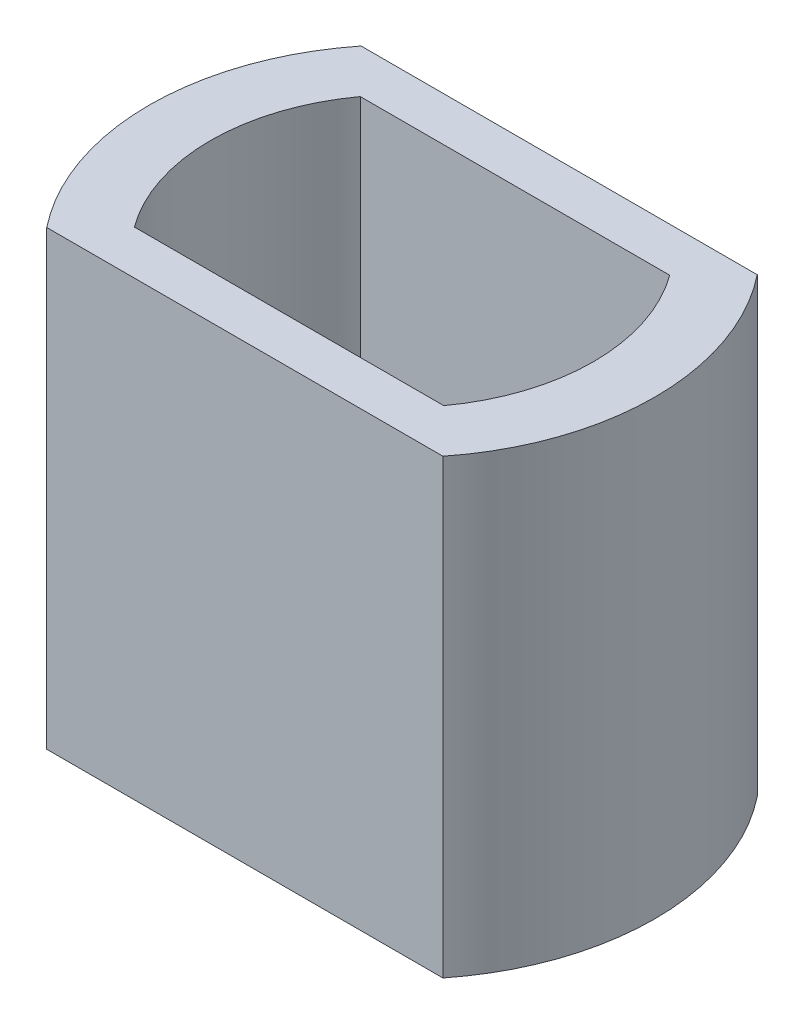
ISO-10303-21;
HEADER;
FILE_DESCRIPTION(('STEP AP214'),'2;1');
FILE_NAME('part.step','',(''),(''),'','','');
FILE_SCHEMA(('AUTOMOTIVE_DESIGN { 1 0 10303 214 1 1 1 1 }'));
ENDSEC;
DATA;
#1=APPLICATION_CONTEXT('core data for automotive mechanical design processes');
#2=APPLICATION_PROTOCOL_DEFINITION('international standard','automotive_design',2000,#1);
#3=PRODUCT_CONTEXT('',#1,'mechanical');
#4=PRODUCT('Part','Part','',(#3));
#5=PRODUCT_RELATED_PRODUCT_CATEGORY('part','',(#4));
#6=PRODUCT_DEFINITION_FORMATION('','',#4);
#7=PRODUCT_DEFINITION_CONTEXT('part definition',#1,'design');
#8=PRODUCT_DEFINITION('design','',#6,#7);
#9=PRODUCT_DEFINITION_SHAPE('','',#8);
#10=(LENGTH_UNIT() NAMED_UNIT(*) SI_UNIT(.MILLI.,.METRE.));
#11=(NAMED_UNIT(*) PLANE_ANGLE_UNIT() SI_UNIT($,.RADIAN.));
#12=(NAMED_UNIT(*) SI_UNIT($,.STERADIAN.) SOLID_ANGLE_UNIT());
#13=UNCERTAINTY_MEASURE_WITH_UNIT(LENGTH_MEASURE(1.E-05),#10,'distance_accuracy_value','');
#14=(GEOMETRIC_REPRESENTATION_CONTEXT(3) GLOBAL_UNCERTAINTY_ASSIGNED_CONTEXT((#13)) GLOBAL_UNIT_ASSIGNED_CONTEXT((#10,
#11,#12)) REPRESENTATION_CONTEXT('',''));
#15=CARTESIAN_POINT('',(0.,0.,0.));
#16=DIRECTION('',(0.,0.,1.));
#17=DIRECTION('',(1.,0.,0.));
#18=AXIS2_PLACEMENT_3D('',#15,#16,#17);
#19=CARTESIAN_POINT('',(0.,5.842,0.));
#20=DIRECTION('',(0.,1.,0.));
#21=DIRECTION('',(0.,0.,1.));
#22=AXIS2_PLACEMENT_3D('',#19,#20,#21);
#23=PLANE('',#22);
#24=CARTESIAN_POINT('',(0.,5.842,0.));
#25=DIRECTION('',(0.,1.,0.));
#26=DIRECTION('',(0.,0.,1.));
#27=AXIS2_PLACEMENT_3D('',#24,#25,#26);
#28=CIRCLE('',#27,3.26898);
#29=CARTESIAN_POINT('',(2.5607042469602,5.842,2.032));
#30=VERTEX_POINT('',#29);
#31=CARTESIAN_POINT('',(2.5607042469602,5.842,-2.032));
#32=VERTEX_POINT('',#31);
#33=EDGE_CURVE('E134',#30,#32,#28,.T.);
#34=ORIENTED_EDGE('',*,*,#33,.T.);
#35=DIRECTION('',(-1.,0.,0.));
#36=VECTOR('',#35,1.);
#37=CARTESIAN_POINT('',(2.41980019356798,5.842,-2.032));
#38=LINE('',#37,#36);
#39=CARTESIAN_POINT('',(-2.5607042469602,5.842,-2.032));
#40=VERTEX_POINT('',#39);
#41=EDGE_CURVE('E137',#32,#40,#38,.T.);
#42=ORIENTED_EDGE('',*,*,#41,.T.);
#43=CARTESIAN_POINT('',(0.,5.842,0.));
#44=DIRECTION('',(0.,1.,0.));
#45=DIRECTION('',(0.,0.,1.));
#46=AXIS2_PLACEMENT_3D('',#43,#44,#45);
#47=CIRCLE('',#46,3.26898);
#48=CARTESIAN_POINT('',(-2.5607042469602,5.842,2.032));
#49=VERTEX_POINT('',#48);
#50=EDGE_CURVE('E140',#40,#49,#47,.T.);
#51=ORIENTED_EDGE('',*,*,#50,.T.);
#52=DIRECTION('',(1.,0.,0.));
#53=VECTOR('',#52,1.);
#54=CARTESIAN_POINT('',(-2.4765,5.842,2.032));
#55=LINE('',#54,#53);
#56=EDGE_CURVE('E142',#49,#30,#55,.T.);
#57=ORIENTED_EDGE('',*,*,#56,.T.);
#58=EDGE_LOOP('',(#34,#42,#51,#57));
#59=FACE_BOUND('',#58,.T.);
#60=DIRECTION('',(1.,0.,0.));
#61=VECTOR('',#60,1.);
#62=CARTESIAN_POINT('',(1.999997999999,5.842,1.4605));
#63=LINE('',#62,#61);
#64=CARTESIAN_POINT('',(-1.999997999999,5.842,1.4605));
#65=VERTEX_POINT('',#64);
#66=CARTESIAN_POINT('',(1.999997999999,5.842,1.4605));
#67=VERTEX_POINT('',#66);
#68=EDGE_CURVE('E106',#65,#67,#63,.T.);
#69=ORIENTED_EDGE('',*,*,#68,.F.);
#70=CARTESIAN_POINT('',(0.,5.842,0.));
#71=DIRECTION('',(0.,1.,0.));
#72=DIRECTION('',(0.,0.,1.));
#73=AXIS2_PLACEMENT_3D('',#70,#71,#72);
#74=CIRCLE('',#73,2.4765);
#75=CARTESIAN_POINT('',(-1.999997999999,5.842,-1.4605));
#76=VERTEX_POINT('',#75);
#77=EDGE_CURVE('E98',#76,#65,#74,.T.);
#78=ORIENTED_EDGE('',*,*,#77,.F.);
#79=DIRECTION('',(-1.,0.,0.));
#80=VECTOR('',#79,1.);
#81=CARTESIAN_POINT('',(1.999997999999,5.842,-1.4605));
#82=LINE('',#81,#80);
#83=CARTESIAN_POINT('',(1.999997999999,5.842,-1.4605));
#84=VERTEX_POINT('',#83);
#85=EDGE_CURVE('E120',#84,#76,#82,.T.);
#86=ORIENTED_EDGE('',*,*,#85,.F.);
#87=CARTESIAN_POINT('',(0.,5.842,0.));
#88=DIRECTION('',(0.,1.,0.));
#89=DIRECTION('',(0.,0.,1.));
#90=AXIS2_PLACEMENT_3D('',#87,#88,#89);
#91=CIRCLE('',#90,2.4765);
#92=EDGE_CURVE('E118',#67,#84,#91,.T.);
#93=ORIENTED_EDGE('',*,*,#92,.F.);
#94=EDGE_LOOP('',(#69,#78,#86,#93));
#95=FACE_BOUND('',#94,.T.);
#96=ADVANCED_FACE('F33',(#59,#95),#23,.T.);
#97=CARTESIAN_POINT('',(0.,0.,0.));
#98=DIRECTION('',(0.,1.,0.));
#99=DIRECTION('',(0.,0.,1.));
#100=AXIS2_PLACEMENT_3D('',#97,#98,#99);
#101=PLANE('',#100);
#102=CARTESIAN_POINT('',(0.,0.,0.));
#103=DIRECTION('',(0.,1.,0.));
#104=DIRECTION('',(0.,0.,1.));
#105=AXIS2_PLACEMENT_3D('',#102,#103,#104);
#106=CIRCLE('',#105,3.26898);
#107=CARTESIAN_POINT('',(2.5607042469602,0.,2.032));
#108=VERTEX_POINT('',#107);
#109=CARTESIAN_POINT('',(2.5607042469602,0.,-2.032));
#110=VERTEX_POINT('',#109);
#111=EDGE_CURVE('E114',#108,#110,#106,.T.);
#112=ORIENTED_EDGE('',*,*,#111,.F.);
#113=DIRECTION('',(1.,0.,0.));
#114=VECTOR('',#113,1.);
#115=CARTESIAN_POINT('',(2.4765,0.,2.032));
#116=LINE('',#115,#114);
#117=CARTESIAN_POINT('',(-2.5607042469602,0.,2.032));
#118=VERTEX_POINT('',#117);
#119=EDGE_CURVE('E138',#118,#108,#116,.T.);
#120=ORIENTED_EDGE('',*,*,#119,.F.);
#121=CARTESIAN_POINT('',(0.,0.,0.));
#122=DIRECTION('',(0.,1.,0.));
#123=DIRECTION('',(0.,0.,1.));
#124=AXIS2_PLACEMENT_3D('',#121,#122,#123);
#125=CIRCLE('',#124,3.26898);
#126=CARTESIAN_POINT('',(-2.5607042469602,0.,-2.032));
#127=VERTEX_POINT('',#126);
#128=EDGE_CURVE('E149',#127,#118,#125,.T.);
#129=ORIENTED_EDGE('',*,*,#128,.F.);
#130=DIRECTION('',(-1.,0.,0.));
#131=VECTOR('',#130,1.);
#132=CARTESIAN_POINT('',(-2.53319980643201,0.,-2.032));
#133=LINE('',#132,#131);
#134=EDGE_CURVE('E147',#110,#127,#133,.T.);
#135=ORIENTED_EDGE('',*,*,#134,.F.);
#136=EDGE_LOOP('',(#112,#120,#129,#135));
#137=FACE_BOUND('',#136,.T.);
#138=CARTESIAN_POINT('',(0.,0.,0.));
#139=DIRECTION('',(0.,1.,0.));
#140=DIRECTION('',(0.,0.,1.));
#141=AXIS2_PLACEMENT_3D('',#138,#139,#140);
#142=CIRCLE('',#141,2.4765);
#143=CARTESIAN_POINT('',(-1.999997999999,0.,-1.4605));
#144=VERTEX_POINT('',#143);
#145=CARTESIAN_POINT('',(-1.999997999999,0.,1.4605));
#146=VERTEX_POINT('',#145);
#147=EDGE_CURVE('E56',#144,#146,#142,.T.);
#148=ORIENTED_EDGE('',*,*,#147,.T.);
#149=DIRECTION('',(1.,0.,0.));
#150=VECTOR('',#149,1.);
#151=CARTESIAN_POINT('',(1.999997999999,0.,1.4605));
#152=LINE('',#151,#150);
#153=CARTESIAN_POINT('',(1.999997999999,0.,1.4605));
#154=VERTEX_POINT('',#153);
#155=EDGE_CURVE('E113',#146,#154,#152,.T.);
#156=ORIENTED_EDGE('',*,*,#155,.T.);
#157=CARTESIAN_POINT('',(0.,0.,0.));
#158=DIRECTION('',(0.,1.,0.));
#159=DIRECTION('',(0.,0.,1.));
#160=AXIS2_PLACEMENT_3D('',#157,#158,#159);
#161=CIRCLE('',#160,2.4765);
#162=CARTESIAN_POINT('',(1.999997999999,0.,-1.4605));
#163=VERTEX_POINT('',#162);
#164=EDGE_CURVE('E126',#154,#163,#161,.T.);
#165=ORIENTED_EDGE('',*,*,#164,.T.);
#166=DIRECTION('',(-1.,0.,0.));
#167=VECTOR('',#166,1.);
#168=CARTESIAN_POINT('',(1.999997999999,0.,-1.4605));
#169=LINE('',#168,#167);
#170=EDGE_CURVE('E107',#163,#144,#169,.T.);
#171=ORIENTED_EDGE('',*,*,#170,.T.);
#172=EDGE_LOOP('',(#148,#156,#165,#171));
#173=FACE_BOUND('',#172,.T.);
#174=ADVANCED_FACE('F167',(#137,#173),#101,.F.);
#175=CARTESIAN_POINT('',(0.,5.842,0.));
#176=DIRECTION('',(0.,-1.,0.));
#177=DIRECTION('',(0.,0.,-1.));
#178=AXIS2_PLACEMENT_3D('',#175,#176,#177);
#179=CYLINDRICAL_SURFACE('',#178,3.26898);
#180=ORIENTED_EDGE('',*,*,#111,.T.);
#181=DIRECTION('',(0.,-1.,0.));
#182=VECTOR('',#181,1.);
#183=CARTESIAN_POINT('',(2.5607042469602,5.842,-2.032));
#184=LINE('',#183,#182);
#185=EDGE_CURVE('E11',#32,#110,#184,.T.);
#186=ORIENTED_EDGE('',*,*,#185,.F.);
#187=ORIENTED_EDGE('',*,*,#33,.F.);
#188=DIRECTION('',(0.,-1.,0.));
#189=VECTOR('',#188,1.);
#190=CARTESIAN_POINT('',(2.5607042469602,5.842,2.032));
#191=LINE('',#190,#189);
#192=EDGE_CURVE('E144',#30,#108,#191,.T.);
#193=ORIENTED_EDGE('',*,*,#192,.T.);
#194=EDGE_LOOP('',(#180,#186,#187,#193));
#195=FACE_BOUND('',#194,.T.);
#196=ADVANCED_FACE('F35',(#195),#179,.T.);
#197=CARTESIAN_POINT('',(-2.53319980643201,5.842,-2.032));
#198=DIRECTION('',(0.,0.,1.));
#199=DIRECTION('',(1.,0.,0.));
#200=AXIS2_PLACEMENT_3D('',#197,#198,#199);
#201=PLANE('',#200);
#202=ORIENTED_EDGE('',*,*,#134,.T.);
#203=DIRECTION('',(0.,-1.,0.));
#204=VECTOR('',#203,1.);
#205=CARTESIAN_POINT('',(-2.5607042469602,5.842,-2.032));
#206=LINE('',#205,#204);
#207=EDGE_CURVE('E41',#40,#127,#206,.T.);
#208=ORIENTED_EDGE('',*,*,#207,.F.);
#209=ORIENTED_EDGE('',*,*,#41,.F.);
#210=ORIENTED_EDGE('',*,*,#185,.T.);
#211=EDGE_LOOP('',(#202,#208,#209,#210));
#212=FACE_BOUND('',#211,.T.);
#213=ADVANCED_FACE('F177',(#212),#201,.F.);
#214=CARTESIAN_POINT('',(0.,5.842,0.));
#215=DIRECTION('',(0.,-1.,0.));
#216=DIRECTION('',(0.,0.,-1.));
#217=AXIS2_PLACEMENT_3D('',#214,#215,#216);
#218=CYLINDRICAL_SURFACE('',#217,3.26898);
#219=ORIENTED_EDGE('',*,*,#128,.T.);
#220=DIRECTION('',(0.,-1.,0.));
#221=VECTOR('',#220,1.);
#222=CARTESIAN_POINT('',(-2.5607042469602,5.842,2.032));
#223=LINE('',#222,#221);
#224=EDGE_CURVE('E155',#49,#118,#223,.T.);
#225=ORIENTED_EDGE('',*,*,#224,.F.);
#226=ORIENTED_EDGE('',*,*,#50,.F.);
#227=ORIENTED_EDGE('',*,*,#207,.T.);
#228=EDGE_LOOP('',(#219,#225,#226,#227));
#229=FACE_BOUND('',#228,.T.);
#230=ADVANCED_FACE('F162',(#229),#218,.T.);
#231=CARTESIAN_POINT('',(2.4765,5.842,2.032));
#232=DIRECTION('',(0.,0.,-1.));
#233=DIRECTION('',(-1.,0.,0.));
#234=AXIS2_PLACEMENT_3D('',#231,#232,#233);
#235=PLANE('',#234);
#236=ORIENTED_EDGE('',*,*,#119,.T.);
#237=ORIENTED_EDGE('',*,*,#192,.F.);
#238=ORIENTED_EDGE('',*,*,#56,.F.);
#239=ORIENTED_EDGE('',*,*,#224,.T.);
#240=EDGE_LOOP('',(#236,#237,#238,#239));
#241=FACE_BOUND('',#240,.T.);
#242=ADVANCED_FACE('F171',(#241),#235,.F.);
#243=CARTESIAN_POINT('',(0.,5.842,0.));
#244=DIRECTION('',(0.,-1.,0.));
#245=DIRECTION('',(0.,0.,-1.));
#246=AXIS2_PLACEMENT_3D('',#243,#244,#245);
#247=CYLINDRICAL_SURFACE('',#246,2.4765);
#248=ORIENTED_EDGE('',*,*,#147,.F.);
#249=DIRECTION('',(0.,-1.,0.));
#250=VECTOR('',#249,1.);
#251=CARTESIAN_POINT('',(-1.999997999999,5.842,-1.4605));
#252=LINE('',#251,#250);
#253=EDGE_CURVE('E102',#76,#144,#252,.T.);
#254=ORIENTED_EDGE('',*,*,#253,.F.);
#255=ORIENTED_EDGE('',*,*,#77,.T.);
#256=DIRECTION('',(0.,-1.,0.));
#257=VECTOR('',#256,1.);
#258=CARTESIAN_POINT('',(-1.999997999999,5.842,1.4605));
#259=LINE('',#258,#257);
#260=EDGE_CURVE('E101',#65,#146,#259,.T.);
#261=ORIENTED_EDGE('',*,*,#260,.T.);
#262=EDGE_LOOP('',(#248,#254,#255,#261));
#263=FACE_BOUND('',#262,.T.);
#264=ADVANCED_FACE('F100',(#263),#247,.F.);
#265=CARTESIAN_POINT('',(1.999997999999,5.842,1.4605));
#266=DIRECTION('',(0.,0.,-1.));
#267=DIRECTION('',(-1.,0.,0.));
#268=AXIS2_PLACEMENT_3D('',#265,#266,#267);
#269=PLANE('',#268);
#270=ORIENTED_EDGE('',*,*,#155,.F.);
#271=ORIENTED_EDGE('',*,*,#260,.F.);
#272=ORIENTED_EDGE('',*,*,#68,.T.);
#273=DIRECTION('',(0.,-1.,0.));
#274=VECTOR('',#273,1.);
#275=CARTESIAN_POINT('',(1.999997999999,5.842,1.4605));
#276=LINE('',#275,#274);
#277=EDGE_CURVE('E115',#67,#154,#276,.T.);
#278=ORIENTED_EDGE('',*,*,#277,.T.);
#279=EDGE_LOOP('',(#270,#271,#272,#278));
#280=FACE_BOUND('',#279,.T.);
#281=ADVANCED_FACE('F110',(#280),#269,.T.);
#282=CARTESIAN_POINT('',(0.,5.842,0.));
#283=DIRECTION('',(0.,-1.,0.));
#284=DIRECTION('',(0.,0.,-1.));
#285=AXIS2_PLACEMENT_3D('',#282,#283,#284);
#286=CYLINDRICAL_SURFACE('',#285,2.4765);
#287=ORIENTED_EDGE('',*,*,#164,.F.);
#288=ORIENTED_EDGE('',*,*,#277,.F.);
#289=ORIENTED_EDGE('',*,*,#92,.T.);
#290=DIRECTION('',(0.,-1.,0.));
#291=VECTOR('',#290,1.);
#292=CARTESIAN_POINT('',(1.999997999999,5.842,-1.4605));
#293=LINE('',#292,#291);
#294=EDGE_CURVE('E48',#84,#163,#293,.T.);
#295=ORIENTED_EDGE('',*,*,#294,.T.);
#296=EDGE_LOOP('',(#287,#288,#289,#295));
#297=FACE_BOUND('',#296,.T.);
#298=ADVANCED_FACE('F200',(#297),#286,.F.);
#299=CARTESIAN_POINT('',(1.999997999999,5.842,-1.4605));
#300=DIRECTION('',(0.,0.,1.));
#301=DIRECTION('',(1.,0.,0.));
#302=AXIS2_PLACEMENT_3D('',#299,#300,#301);
#303=PLANE('',#302);
#304=ORIENTED_EDGE('',*,*,#170,.F.);
#305=ORIENTED_EDGE('',*,*,#294,.F.);
#306=ORIENTED_EDGE('',*,*,#85,.T.);
#307=ORIENTED_EDGE('',*,*,#253,.T.);
#308=EDGE_LOOP('',(#304,#305,#306,#307));
#309=FACE_BOUND('',#308,.T.);
#310=ADVANCED_FACE('F204',(#309),#303,.T.);
#311=CLOSED_SHELL('',(#96,#174,#196,#213,#230,#242,#264,#281,#298,#310));
#312=MANIFOLD_SOLID_BREP('B2',#311);
#313=ADVANCED_BREP_SHAPE_REPRESENTATION('',(#18,#312),#14);
#314=SHAPE_DEFINITION_REPRESENTATION(#9,#313);
ENDSEC;
END-ISO-10303-21;
